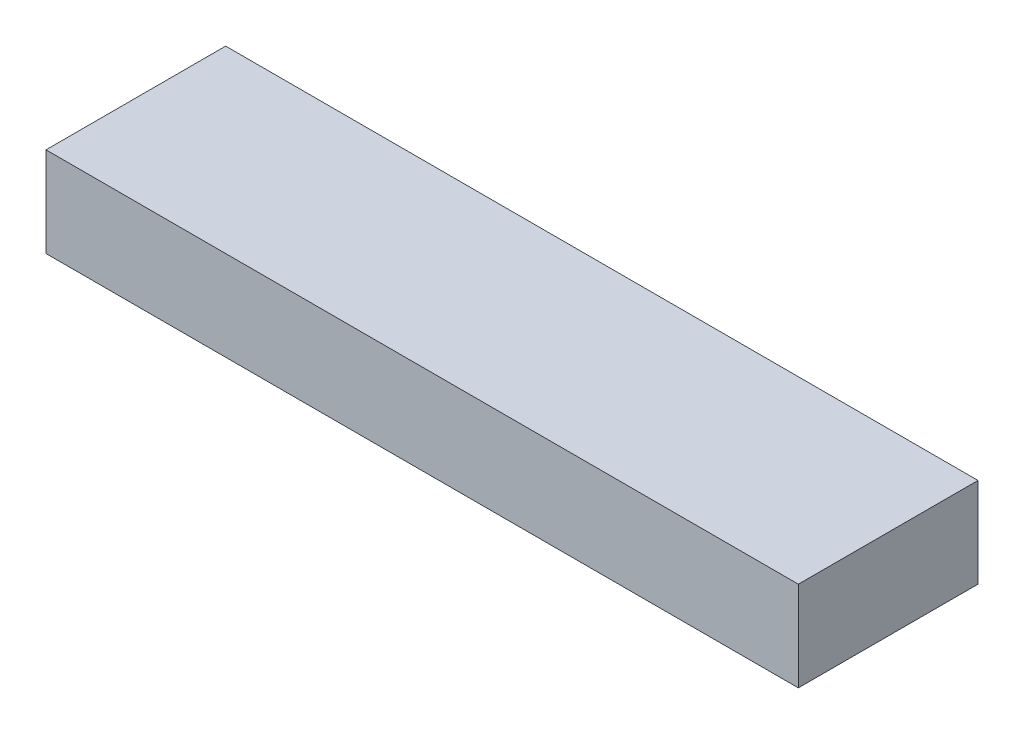
ISO-10303-21;
HEADER;
FILE_DESCRIPTION(('STEP AP214'),'2;1');
FILE_NAME('part.step','',(''),(''),'','','');
FILE_SCHEMA(('AUTOMOTIVE_DESIGN { 1 0 10303 214 1 1 1 1 }'));
ENDSEC;
DATA;
#1=APPLICATION_CONTEXT('core data for automotive mechanical design processes');
#2=APPLICATION_PROTOCOL_DEFINITION('international standard','automotive_design',2000,#1);
#3=PRODUCT_CONTEXT('',#1,'mechanical');
#4=PRODUCT('Part','Part','',(#3));
#5=PRODUCT_RELATED_PRODUCT_CATEGORY('part','',(#4));
#6=PRODUCT_DEFINITION_FORMATION('','',#4);
#7=PRODUCT_DEFINITION_CONTEXT('part definition',#1,'design');
#8=PRODUCT_DEFINITION('design','',#6,#7);
#9=PRODUCT_DEFINITION_SHAPE('','',#8);
#10=(LENGTH_UNIT() NAMED_UNIT(*) SI_UNIT(.MILLI.,.METRE.));
#11=(NAMED_UNIT(*) PLANE_ANGLE_UNIT() SI_UNIT($,.RADIAN.));
#12=(NAMED_UNIT(*) SI_UNIT($,.STERADIAN.) SOLID_ANGLE_UNIT());
#13=UNCERTAINTY_MEASURE_WITH_UNIT(LENGTH_MEASURE(1.E-05),#10,'distance_accuracy_value','');
#14=(GEOMETRIC_REPRESENTATION_CONTEXT(3) GLOBAL_UNCERTAINTY_ASSIGNED_CONTEXT((#13)) GLOBAL_UNIT_ASSIGNED_CONTEXT((#10,
#11,#12)) REPRESENTATION_CONTEXT('',''));
#15=CARTESIAN_POINT('',(0.,0.,0.));
#16=DIRECTION('',(0.,0.,1.));
#17=DIRECTION('',(1.,0.,0.));
#18=AXIS2_PLACEMENT_3D('',#15,#16,#17);
#19=CARTESIAN_POINT('',(212.725,25.4,50.8));
#20=DIRECTION('',(-1.,0.,0.));
#21=DIRECTION('',(0.,0.,1.));
#22=AXIS2_PLACEMENT_3D('',#19,#20,#21);
#23=PLANE('',#22);
#24=DIRECTION('',(0.,0.,-1.));
#25=VECTOR('',#24,1.);
#26=CARTESIAN_POINT('',(212.725,-25.4,50.8));
#27=LINE('',#26,#25);
#28=CARTESIAN_POINT('',(212.725,-25.4,50.8));
#29=VERTEX_POINT('',#28);
#30=CARTESIAN_POINT('',(212.725,-25.4,-50.8));
#31=VERTEX_POINT('',#30);
#32=EDGE_CURVE('E111',#29,#31,#27,.T.);
#33=ORIENTED_EDGE('',*,*,#32,.T.);
#34=DIRECTION('',(0.,-1.,0.));
#35=VECTOR('',#34,1.);
#36=CARTESIAN_POINT('',(212.725,25.4,-50.8));
#37=LINE('',#36,#35);
#38=CARTESIAN_POINT('',(212.725,25.4,-50.8));
#39=VERTEX_POINT('',#38);
#40=EDGE_CURVE('E11',#39,#31,#37,.T.);
#41=ORIENTED_EDGE('',*,*,#40,.F.);
#42=DIRECTION('',(0.,0.,-1.));
#43=VECTOR('',#42,1.);
#44=CARTESIAN_POINT('',(212.725,25.4,50.8));
#45=LINE('',#44,#43);
#46=CARTESIAN_POINT('',(212.725,25.4,50.8));
#47=VERTEX_POINT('',#46);
#48=EDGE_CURVE('E95',#47,#39,#45,.T.);
#49=ORIENTED_EDGE('',*,*,#48,.F.);
#50=DIRECTION('',(0.,-1.,0.));
#51=VECTOR('',#50,1.);
#52=CARTESIAN_POINT('',(212.725,25.4,50.8));
#53=LINE('',#52,#51);
#54=EDGE_CURVE('E107',#47,#29,#53,.T.);
#55=ORIENTED_EDGE('',*,*,#54,.T.);
#56=EDGE_LOOP('',(#33,#41,#49,#55));
#57=FACE_BOUND('',#56,.T.);
#58=ADVANCED_FACE('F43',(#57),#23,.F.);
#59=CARTESIAN_POINT('',(-212.725,25.4,-50.8));
#60=DIRECTION('',(0.,0.,1.));
#61=DIRECTION('',(1.,0.,0.));
#62=AXIS2_PLACEMENT_3D('',#59,#60,#61);
#63=PLANE('',#62);
#64=DIRECTION('',(-1.,0.,0.));
#65=VECTOR('',#64,1.);
#66=CARTESIAN_POINT('',(-212.725,-25.4,-50.8));
#67=LINE('',#66,#65);
#68=CARTESIAN_POINT('',(-212.725,-25.4,-50.8));
#69=VERTEX_POINT('',#68);
#70=EDGE_CURVE('E100',#31,#69,#67,.T.);
#71=ORIENTED_EDGE('',*,*,#70,.T.);
#72=DIRECTION('',(0.,-1.,0.));
#73=VECTOR('',#72,1.);
#74=CARTESIAN_POINT('',(-212.725,25.4,-50.8));
#75=LINE('',#74,#73);
#76=CARTESIAN_POINT('',(-212.725,25.4,-50.8));
#77=VERTEX_POINT('',#76);
#78=EDGE_CURVE('E52',#77,#69,#75,.T.);
#79=ORIENTED_EDGE('',*,*,#78,.F.);
#80=DIRECTION('',(-1.,0.,0.));
#81=VECTOR('',#80,1.);
#82=CARTESIAN_POINT('',(-212.725,25.4,-50.8));
#83=LINE('',#82,#81);
#84=EDGE_CURVE('E90',#39,#77,#83,.T.);
#85=ORIENTED_EDGE('',*,*,#84,.F.);
#86=ORIENTED_EDGE('',*,*,#40,.T.);
#87=EDGE_LOOP('',(#71,#79,#85,#86));
#88=FACE_BOUND('',#87,.T.);
#89=ADVANCED_FACE('F99',(#88),#63,.F.);
#90=CARTESIAN_POINT('',(-212.725,25.4,50.8));
#91=DIRECTION('',(1.,0.,0.));
#92=DIRECTION('',(0.,0.,-1.));
#93=AXIS2_PLACEMENT_3D('',#90,#91,#92);
#94=PLANE('',#93);
#95=DIRECTION('',(0.,0.,1.));
#96=VECTOR('',#95,1.);
#97=CARTESIAN_POINT('',(-212.725,-25.4,50.8));
#98=LINE('',#97,#96);
#99=CARTESIAN_POINT('',(-212.725,-25.4,50.8));
#100=VERTEX_POINT('',#99);
#101=EDGE_CURVE('E77',#69,#100,#98,.T.);
#102=ORIENTED_EDGE('',*,*,#101,.T.);
#103=DIRECTION('',(0.,-1.,0.));
#104=VECTOR('',#103,1.);
#105=CARTESIAN_POINT('',(-212.725,25.4,50.8));
#106=LINE('',#105,#104);
#107=CARTESIAN_POINT('',(-212.725,25.4,50.8));
#108=VERTEX_POINT('',#107);
#109=EDGE_CURVE('E102',#108,#100,#106,.T.);
#110=ORIENTED_EDGE('',*,*,#109,.F.);
#111=DIRECTION('',(0.,0.,1.));
#112=VECTOR('',#111,1.);
#113=CARTESIAN_POINT('',(-212.725,25.4,50.8));
#114=LINE('',#113,#112);
#115=EDGE_CURVE('E93',#77,#108,#114,.T.);
#116=ORIENTED_EDGE('',*,*,#115,.F.);
#117=ORIENTED_EDGE('',*,*,#78,.T.);
#118=EDGE_LOOP('',(#102,#110,#116,#117));
#119=FACE_BOUND('',#118,.T.);
#120=ADVANCED_FACE('F103',(#119),#94,.F.);
#121=CARTESIAN_POINT('',(-212.725,25.4,50.8));
#122=DIRECTION('',(0.,0.,-1.));
#123=DIRECTION('',(-1.,0.,0.));
#124=AXIS2_PLACEMENT_3D('',#121,#122,#123);
#125=PLANE('',#124);
#126=DIRECTION('',(1.,0.,0.));
#127=VECTOR('',#126,1.);
#128=CARTESIAN_POINT('',(-212.725,-25.4,50.8));
#129=LINE('',#128,#127);
#130=EDGE_CURVE('E83',#100,#29,#129,.T.);
#131=ORIENTED_EDGE('',*,*,#130,.T.);
#132=ORIENTED_EDGE('',*,*,#54,.F.);
#133=DIRECTION('',(1.,0.,0.));
#134=VECTOR('',#133,1.);
#135=CARTESIAN_POINT('',(-212.725,25.4,50.8));
#136=LINE('',#135,#134);
#137=EDGE_CURVE('E60',#108,#47,#136,.T.);
#138=ORIENTED_EDGE('',*,*,#137,.F.);
#139=ORIENTED_EDGE('',*,*,#109,.T.);
#140=EDGE_LOOP('',(#131,#132,#138,#139));
#141=FACE_BOUND('',#140,.T.);
#142=ADVANCED_FACE('F124',(#141),#125,.F.);
#143=CARTESIAN_POINT('',(0.,25.4,0.));
#144=DIRECTION('',(0.,-1.,0.));
#145=DIRECTION('',(0.,0.,-1.));
#146=AXIS2_PLACEMENT_3D('',#143,#144,#145);
#147=PLANE('',#146);
#148=ORIENTED_EDGE('',*,*,#48,.T.);
#149=ORIENTED_EDGE('',*,*,#84,.T.);
#150=ORIENTED_EDGE('',*,*,#115,.T.);
#151=ORIENTED_EDGE('',*,*,#137,.T.);
#152=EDGE_LOOP('',(#148,#149,#150,#151));
#153=FACE_BOUND('',#152,.T.);
#154=ADVANCED_FACE('F91',(#153),#147,.F.);
#155=CARTESIAN_POINT('',(0.,-25.4,0.));
#156=DIRECTION('',(0.,-1.,0.));
#157=DIRECTION('',(0.,0.,-1.));
#158=AXIS2_PLACEMENT_3D('',#155,#156,#157);
#159=PLANE('',#158);
#160=ORIENTED_EDGE('',*,*,#32,.F.);
#161=ORIENTED_EDGE('',*,*,#130,.F.);
#162=ORIENTED_EDGE('',*,*,#101,.F.);
#163=ORIENTED_EDGE('',*,*,#70,.F.);
#164=EDGE_LOOP('',(#160,#161,#162,#163));
#165=FACE_BOUND('',#164,.T.);
#166=ADVANCED_FACE('F127',(#165),#159,.T.);
#167=CLOSED_SHELL('',(#58,#89,#120,#142,#154,#166));
#168=MANIFOLD_SOLID_BREP('B2',#167);
#169=ADVANCED_BREP_SHAPE_REPRESENTATION('',(#18,#168),#14);
#170=SHAPE_DEFINITION_REPRESENTATION(#9,#169);
ENDSEC;
END-ISO-10303-21;
